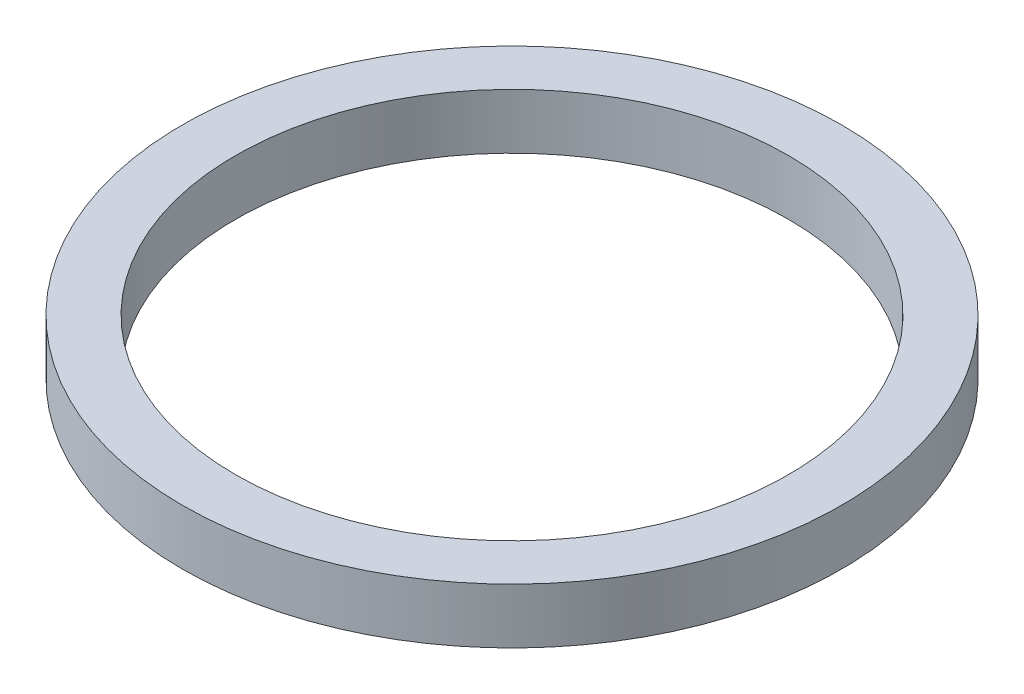
ISO-10303-21;
HEADER;
FILE_DESCRIPTION(('STEP AP214'),'2;1');
FILE_NAME('part.step','',(''),(''),'','','');
FILE_SCHEMA(('AUTOMOTIVE_DESIGN { 1 0 10303 214 1 1 1 1 }'));
ENDSEC;
DATA;
#1=APPLICATION_CONTEXT('core data for automotive mechanical design processes');
#2=APPLICATION_PROTOCOL_DEFINITION('international standard','automotive_design',2000,#1);
#3=PRODUCT_CONTEXT('',#1,'mechanical');
#4=PRODUCT('Part','Part','',(#3));
#5=PRODUCT_RELATED_PRODUCT_CATEGORY('part','',(#4));
#6=PRODUCT_DEFINITION_FORMATION('','',#4);
#7=PRODUCT_DEFINITION_CONTEXT('part definition',#1,'design');
#8=PRODUCT_DEFINITION('design','',#6,#7);
#9=PRODUCT_DEFINITION_SHAPE('','',#8);
#10=(LENGTH_UNIT() NAMED_UNIT(*) SI_UNIT(.MILLI.,.METRE.));
#11=(NAMED_UNIT(*) PLANE_ANGLE_UNIT() SI_UNIT($,.RADIAN.));
#12=(NAMED_UNIT(*) SI_UNIT($,.STERADIAN.) SOLID_ANGLE_UNIT());
#13=UNCERTAINTY_MEASURE_WITH_UNIT(LENGTH_MEASURE(1.E-05),#10,'distance_accuracy_value','');
#14=(GEOMETRIC_REPRESENTATION_CONTEXT(3) GLOBAL_UNCERTAINTY_ASSIGNED_CONTEXT((#13)) GLOBAL_UNIT_ASSIGNED_CONTEXT((#10,
#11,#12)) REPRESENTATION_CONTEXT('',''));
#15=CARTESIAN_POINT('',(0.,0.,0.));
#16=DIRECTION('',(0.,0.,1.));
#17=DIRECTION('',(1.,0.,0.));
#18=AXIS2_PLACEMENT_3D('',#15,#16,#17);
#19=CARTESIAN_POINT('',(0.,1.5875,0.));
#20=DIRECTION('',(0.,1.,0.));
#21=DIRECTION('',(0.,0.,1.));
#22=AXIS2_PLACEMENT_3D('',#19,#20,#21);
#23=PLANE('',#22);
#24=CARTESIAN_POINT('',(0.,1.5875,0.));
#25=DIRECTION('',(0.,1.,0.));
#26=DIRECTION('',(0.,0.,1.));
#27=AXIS2_PLACEMENT_3D('',#24,#25,#26);
#28=CIRCLE('',#27,9.4615);
#29=CARTESIAN_POINT('',(0.,1.5875,9.4615));
#30=VERTEX_POINT('',#29);
#31=EDGE_CURVE('E10',#30,#30,#28,.T.);
#32=ORIENTED_EDGE('',*,*,#31,.T.);
#33=EDGE_LOOP('',(#32));
#34=FACE_BOUND('',#33,.T.);
#35=CARTESIAN_POINT('',(0.,1.5875,0.));
#36=DIRECTION('',(0.,1.,0.));
#37=DIRECTION('',(0.,0.,1.));
#38=AXIS2_PLACEMENT_3D('',#35,#36,#37);
#39=CIRCLE('',#38,7.9375);
#40=CARTESIAN_POINT('',(0.,1.5875,7.9375));
#41=VERTEX_POINT('',#40);
#42=EDGE_CURVE('E42',#41,#41,#39,.T.);
#43=ORIENTED_EDGE('',*,*,#42,.F.);
#44=EDGE_LOOP('',(#43));
#45=FACE_BOUND('',#44,.T.);
#46=ADVANCED_FACE('F31',(#34,#45),#23,.T.);
#47=CARTESIAN_POINT('',(0.,0.,0.));
#48=DIRECTION('',(0.,1.,0.));
#49=DIRECTION('',(0.,0.,1.));
#50=AXIS2_PLACEMENT_3D('',#47,#48,#49);
#51=PLANE('',#50);
#52=CARTESIAN_POINT('',(0.,0.,0.));
#53=DIRECTION('',(0.,1.,0.));
#54=DIRECTION('',(0.,0.,1.));
#55=AXIS2_PLACEMENT_3D('',#52,#53,#54);
#56=CIRCLE('',#55,9.4615);
#57=CARTESIAN_POINT('',(0.,0.,9.4615));
#58=VERTEX_POINT('',#57);
#59=EDGE_CURVE('E35',#58,#58,#56,.T.);
#60=ORIENTED_EDGE('',*,*,#59,.F.);
#61=EDGE_LOOP('',(#60));
#62=FACE_BOUND('',#61,.T.);
#63=CARTESIAN_POINT('',(0.,0.,0.));
#64=DIRECTION('',(0.,1.,0.));
#65=DIRECTION('',(0.,0.,1.));
#66=AXIS2_PLACEMENT_3D('',#63,#64,#65);
#67=CIRCLE('',#66,7.9375);
#68=CARTESIAN_POINT('',(0.,0.,7.9375));
#69=VERTEX_POINT('',#68);
#70=EDGE_CURVE('E44',#69,#69,#67,.T.);
#71=ORIENTED_EDGE('',*,*,#70,.T.);
#72=EDGE_LOOP('',(#71));
#73=FACE_BOUND('',#72,.T.);
#74=ADVANCED_FACE('F54',(#62,#73),#51,.F.);
#75=CARTESIAN_POINT('',(0.,1.5875,0.));
#76=DIRECTION('',(0.,-1.,0.));
#77=DIRECTION('',(0.,0.,-1.));
#78=AXIS2_PLACEMENT_3D('',#75,#76,#77);
#79=CYLINDRICAL_SURFACE('',#78,9.4615);
#80=ORIENTED_EDGE('',*,*,#31,.F.);
#81=EDGE_LOOP('',(#80));
#82=FACE_BOUND('',#81,.T.);
#83=ORIENTED_EDGE('',*,*,#59,.T.);
#84=EDGE_LOOP('',(#83));
#85=FACE_BOUND('',#84,.T.);
#86=ADVANCED_FACE('F33',(#82,#85),#79,.T.);
#87=CARTESIAN_POINT('',(0.,1.5875,0.));
#88=DIRECTION('',(0.,-1.,0.));
#89=DIRECTION('',(0.,0.,-1.));
#90=AXIS2_PLACEMENT_3D('',#87,#88,#89);
#91=CYLINDRICAL_SURFACE('',#90,7.9375);
#92=ORIENTED_EDGE('',*,*,#42,.T.);
#93=EDGE_LOOP('',(#92));
#94=FACE_BOUND('',#93,.T.);
#95=ORIENTED_EDGE('',*,*,#70,.F.);
#96=EDGE_LOOP('',(#95));
#97=FACE_BOUND('',#96,.T.);
#98=ADVANCED_FACE('F50',(#94,#97),#91,.F.);
#99=CLOSED_SHELL('',(#46,#74,#86,#98));
#100=MANIFOLD_SOLID_BREP('B2',#99);
#101=ADVANCED_BREP_SHAPE_REPRESENTATION('',(#18,#100),#14);
#102=SHAPE_DEFINITION_REPRESENTATION(#9,#101);
ENDSEC;
END-ISO-10303-21;
